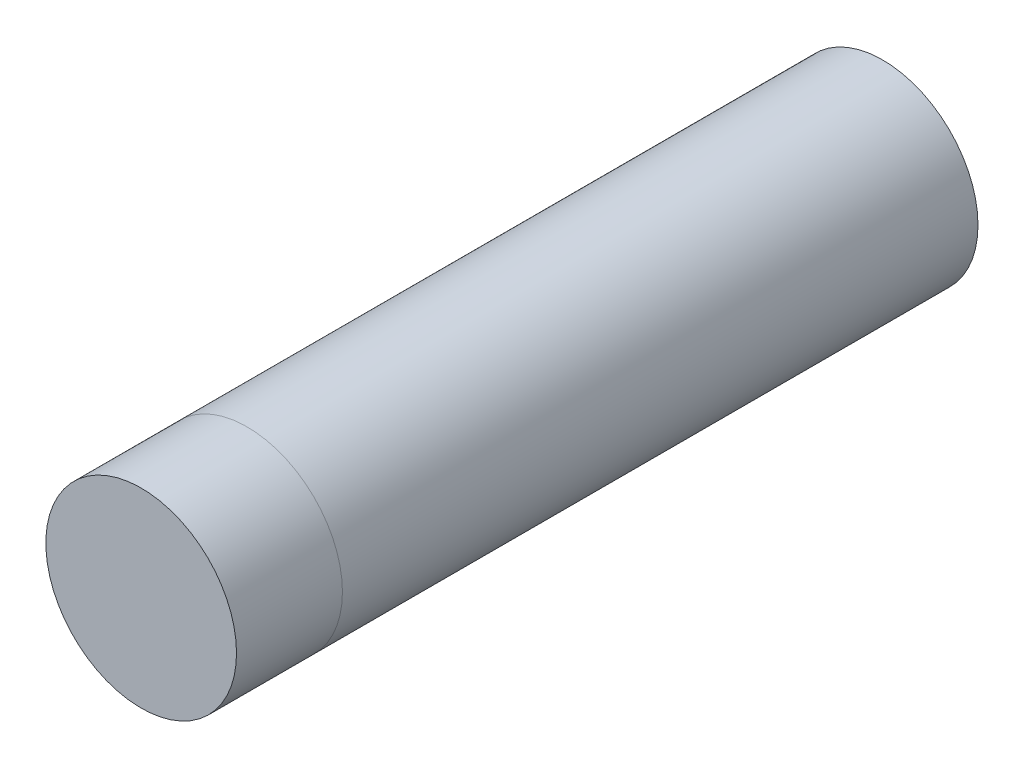
ISO-10303-21;
HEADER;
FILE_DESCRIPTION(('STEP AP214'),'2;1');
FILE_NAME('part.step','',(''),(''),'','','');
FILE_SCHEMA(('AUTOMOTIVE_DESIGN { 1 0 10303 214 1 1 1 1 }'));
ENDSEC;
DATA;
#1=APPLICATION_CONTEXT('core data for automotive mechanical design processes');
#2=APPLICATION_PROTOCOL_DEFINITION('international standard','automotive_design',2000,#1);
#3=PRODUCT_CONTEXT('',#1,'mechanical');
#4=PRODUCT('Part','Part','',(#3));
#5=PRODUCT_RELATED_PRODUCT_CATEGORY('part','',(#4));
#6=PRODUCT_DEFINITION_FORMATION('','',#4);
#7=PRODUCT_DEFINITION_CONTEXT('part definition',#1,'design');
#8=PRODUCT_DEFINITION('design','',#6,#7);
#9=PRODUCT_DEFINITION_SHAPE('','',#8);
#10=(LENGTH_UNIT() NAMED_UNIT(*) SI_UNIT(.MILLI.,.METRE.));
#11=(NAMED_UNIT(*) PLANE_ANGLE_UNIT() SI_UNIT($,.RADIAN.));
#12=(NAMED_UNIT(*) SI_UNIT($,.STERADIAN.) SOLID_ANGLE_UNIT());
#13=UNCERTAINTY_MEASURE_WITH_UNIT(LENGTH_MEASURE(1.E-05),#10,'distance_accuracy_value','');
#14=(GEOMETRIC_REPRESENTATION_CONTEXT(3) GLOBAL_UNCERTAINTY_ASSIGNED_CONTEXT((#13)) GLOBAL_UNIT_ASSIGNED_CONTEXT((#10,
#11,#12)) REPRESENTATION_CONTEXT('',''));
#15=CARTESIAN_POINT('',(0.,0.,0.));
#16=DIRECTION('',(0.,0.,1.));
#17=DIRECTION('',(1.,0.,0.));
#18=AXIS2_PLACEMENT_3D('',#15,#16,#17);
#19=CARTESIAN_POINT('',(0.,0.,70.));
#20=DIRECTION('',(0.,0.,-1.));
#21=DIRECTION('',(-1.,0.,0.));
#22=AXIS2_PLACEMENT_3D('',#19,#20,#21);
#23=CYLINDRICAL_SURFACE('',#22,9.);
#24=CARTESIAN_POINT('',(0.,0.,70.));
#25=DIRECTION('',(0.,0.,1.));
#26=DIRECTION('',(1.,0.,0.));
#27=AXIS2_PLACEMENT_3D('',#24,#25,#26);
#28=CIRCLE('',#27,9.);
#29=CARTESIAN_POINT('',(9.,0.,70.));
#30=VERTEX_POINT('',#29);
#31=EDGE_CURVE('E11',#30,#30,#28,.T.);
#32=ORIENTED_EDGE('',*,*,#31,.F.);
#33=EDGE_LOOP('',(#32));
#34=FACE_BOUND('',#33,.T.);
#35=CARTESIAN_POINT('',(0.,0.,60.));
#36=DIRECTION('',(0.,0.,1.));
#37=DIRECTION('',(1.,0.,0.));
#38=AXIS2_PLACEMENT_3D('',#35,#36,#37);
#39=CIRCLE('',#38,9.);
#40=CARTESIAN_POINT('',(9.,0.,60.));
#41=VERTEX_POINT('',#40);
#42=EDGE_CURVE('E54',#41,#41,#39,.T.);
#43=ORIENTED_EDGE('',*,*,#42,.T.);
#44=EDGE_LOOP('',(#43));
#45=FACE_BOUND('',#44,.T.);
#46=ADVANCED_FACE('F51',(#34,#45),#23,.T.);
#47=CARTESIAN_POINT('',(0.,0.,70.));
#48=DIRECTION('',(0.,0.,1.));
#49=DIRECTION('',(1.,0.,0.));
#50=AXIS2_PLACEMENT_3D('',#47,#48,#49);
#51=PLANE('',#50);
#52=ORIENTED_EDGE('',*,*,#31,.T.);
#53=EDGE_LOOP('',(#52));
#54=FACE_BOUND('',#53,.T.);
#55=ADVANCED_FACE('F66',(#54),#51,.T.);
#56=CARTESIAN_POINT('',(0.,0.,60.));
#57=DIRECTION('',(0.,0.,1.));
#58=DIRECTION('',(1.,0.,0.));
#59=AXIS2_PLACEMENT_3D('',#56,#57,#58);
#60=PLANE('',#59);
#61=ORIENTED_EDGE('',*,*,#42,.F.);
#62=EDGE_LOOP('',(#61));
#63=FACE_BOUND('',#62,.T.);
#64=ADVANCED_FACE('F64',(#63),#60,.F.);
#65=CLOSED_SHELL('',(#46,#55,#64));
#66=MANIFOLD_SOLID_BREP('B2',#65);
#67=CARTESIAN_POINT('',(0.,0.,60.));
#68=DIRECTION('',(0.,0.,-1.));
#69=DIRECTION('',(-1.,0.,0.));
#70=AXIS2_PLACEMENT_3D('',#67,#68,#69);
#71=CYLINDRICAL_SURFACE('',#70,9.);
#72=CARTESIAN_POINT('',(0.,0.,60.));
#73=DIRECTION('',(0.,0.,1.));
#74=DIRECTION('',(1.,0.,0.));
#75=AXIS2_PLACEMENT_3D('',#72,#73,#74);
#76=CIRCLE('',#75,9.);
#77=CARTESIAN_POINT('',(9.,0.,60.));
#78=VERTEX_POINT('',#77);
#79=EDGE_CURVE('E50',#78,#78,#76,.T.);
#80=ORIENTED_EDGE('',*,*,#79,.F.);
#81=EDGE_LOOP('',(#80));
#82=FACE_BOUND('',#81,.T.);
#83=CARTESIAN_POINT('',(0.,0.,0.));
#84=DIRECTION('',(0.,0.,1.));
#85=DIRECTION('',(1.,0.,0.));
#86=AXIS2_PLACEMENT_3D('',#83,#84,#85);
#87=CIRCLE('',#86,9.);
#88=CARTESIAN_POINT('',(9.,0.,0.));
#89=VERTEX_POINT('',#88);
#90=EDGE_CURVE('E101',#89,#89,#87,.T.);
#91=ORIENTED_EDGE('',*,*,#90,.T.);
#92=EDGE_LOOP('',(#91));
#93=FACE_BOUND('',#92,.T.);
#94=ADVANCED_FACE('F98',(#82,#93),#71,.T.);
#95=CARTESIAN_POINT('',(0.,0.,60.));
#96=DIRECTION('',(0.,0.,1.));
#97=DIRECTION('',(1.,0.,0.));
#98=AXIS2_PLACEMENT_3D('',#95,#96,#97);
#99=PLANE('',#98);
#100=ORIENTED_EDGE('',*,*,#79,.T.);
#101=EDGE_LOOP('',(#100));
#102=FACE_BOUND('',#101,.T.);
#103=ADVANCED_FACE('F115',(#102),#99,.T.);
#104=CARTESIAN_POINT('',(0.,0.,0.));
#105=DIRECTION('',(0.,0.,1.));
#106=DIRECTION('',(1.,0.,0.));
#107=AXIS2_PLACEMENT_3D('',#104,#105,#106);
#108=PLANE('',#107);
#109=ORIENTED_EDGE('',*,*,#90,.F.);
#110=EDGE_LOOP('',(#109));
#111=FACE_BOUND('',#110,.T.);
#112=ADVANCED_FACE('F113',(#111),#108,.F.);
#113=CLOSED_SHELL('',(#94,#103,#112));
#114=MANIFOLD_SOLID_BREP('B6',#113);
#115=ADVANCED_BREP_SHAPE_REPRESENTATION('',(#18,#66,#114),#14);
#116=SHAPE_DEFINITION_REPRESENTATION(#9,#115);
ENDSEC;
END-ISO-10303-21;
